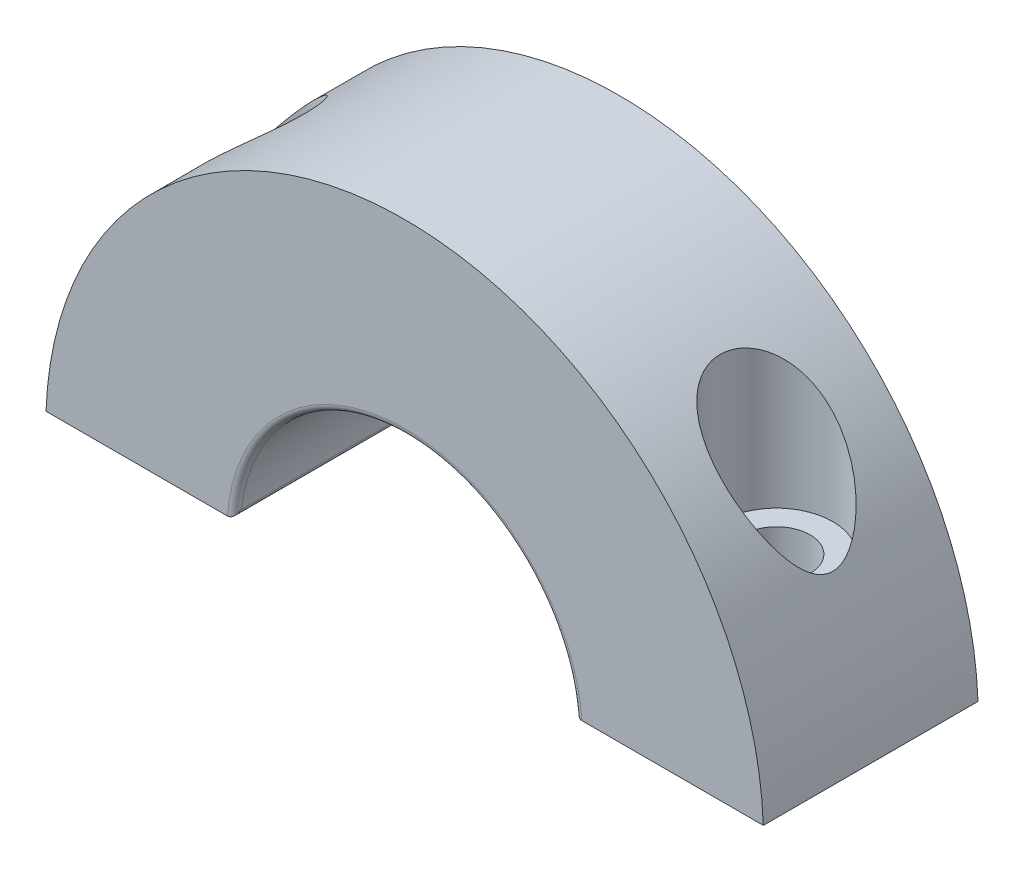
ISO-10303-21;
HEADER;
FILE_DESCRIPTION(('STEP AP214'),'2;1');
FILE_NAME('part.step','',(''),(''),'','','');
FILE_SCHEMA(('AUTOMOTIVE_DESIGN { 1 0 10303 214 1 1 1 1 }'));
ENDSEC;
DATA;
#1=APPLICATION_CONTEXT('core data for automotive mechanical design processes');
#2=APPLICATION_PROTOCOL_DEFINITION('international standard','automotive_design',2000,#1);
#3=PRODUCT_CONTEXT('',#1,'mechanical');
#4=PRODUCT('Part','Part','',(#3));
#5=PRODUCT_RELATED_PRODUCT_CATEGORY('part','',(#4));
#6=PRODUCT_DEFINITION_FORMATION('','',#4);
#7=PRODUCT_DEFINITION_CONTEXT('part definition',#1,'design');
#8=PRODUCT_DEFINITION('design','',#6,#7);
#9=PRODUCT_DEFINITION_SHAPE('','',#8);
#10=(LENGTH_UNIT() NAMED_UNIT(*) SI_UNIT(.MILLI.,.METRE.));
#11=(NAMED_UNIT(*) PLANE_ANGLE_UNIT() SI_UNIT($,.RADIAN.));
#12=(NAMED_UNIT(*) SI_UNIT($,.STERADIAN.) SOLID_ANGLE_UNIT());
#13=UNCERTAINTY_MEASURE_WITH_UNIT(LENGTH_MEASURE(1.E-05),#10,'distance_accuracy_value','');
#14=(GEOMETRIC_REPRESENTATION_CONTEXT(3) GLOBAL_UNCERTAINTY_ASSIGNED_CONTEXT((#13)) GLOBAL_UNIT_ASSIGNED_CONTEXT((#10,
#11,#12)) REPRESENTATION_CONTEXT('',''));
#15=CARTESIAN_POINT('',(0.,0.,0.));
#16=DIRECTION('',(0.,0.,1.));
#17=DIRECTION('',(1.,0.,0.));
#18=AXIS2_PLACEMENT_3D('',#15,#16,#17);
#19=CARTESIAN_POINT('',(0.,50.,8.));
#20=DIRECTION('',(0.,0.,-1.));
#21=DIRECTION('',(-1.,0.,0.));
#22=AXIS2_PLACEMENT_3D('',#19,#20,#21);
#23=CYLINDRICAL_SURFACE('',#22,26.75);
#24=CARTESIAN_POINT('',(0.,50.,-8.));
#25=DIRECTION('',(0.,0.,1.));
#26=DIRECTION('',(1.,0.,0.));
#27=AXIS2_PLACEMENT_3D('',#24,#25,#26);
#28=CIRCLE('',#27,26.75);
#29=CARTESIAN_POINT('',(26.7313018762649,51.,-8.));
#30=VERTEX_POINT('',#29);
#31=CARTESIAN_POINT('',(-26.7313018762649,51.,-8.));
#32=VERTEX_POINT('',#31);
#33=EDGE_CURVE('E240',#30,#32,#28,.T.);
#34=ORIENTED_EDGE('',*,*,#33,.T.);
#35=DIRECTION('',(0.,0.,-1.));
#36=VECTOR('',#35,1.);
#37=CARTESIAN_POINT('',(-26.7313018762649,51.,8.));
#38=LINE('',#37,#36);
#39=CARTESIAN_POINT('',(-26.7313018762649,51.,8.));
#40=VERTEX_POINT('',#39);
#41=EDGE_CURVE('E117',#40,#32,#38,.T.);
#42=ORIENTED_EDGE('',*,*,#41,.F.);
#43=CARTESIAN_POINT('',(0.,50.,8.));
#44=DIRECTION('',(0.,0.,1.));
#45=DIRECTION('',(1.,0.,0.));
#46=AXIS2_PLACEMENT_3D('',#43,#44,#45);
#47=CIRCLE('',#46,26.75);
#48=CARTESIAN_POINT('',(26.7313018762649,51.,8.));
#49=VERTEX_POINT('',#48);
#50=EDGE_CURVE('E105',#49,#40,#47,.T.);
#51=ORIENTED_EDGE('',*,*,#50,.F.);
#52=DIRECTION('',(0.,0.,-1.));
#53=VECTOR('',#52,1.);
#54=CARTESIAN_POINT('',(26.7313018762649,51.,8.));
#55=LINE('',#54,#53);
#56=EDGE_CURVE('E115',#49,#30,#55,.T.);
#57=ORIENTED_EDGE('',*,*,#56,.T.);
#58=EDGE_LOOP('',(#34,#42,#51,#57));
#59=FACE_BOUND('',#58,.T.);
#60=CARTESIAN_POINT('',(19.7107238188861,68.0845200803227,4.20000000000001));
#61=CARTESIAN_POINT('',(19.4714095954293,68.3453463817255,4.20000497816206));
#62=CARTESIAN_POINT('',(19.2266851159006,68.6016351112881,4.17959589245028));
#63=CARTESIAN_POINT('',(18.7310891320525,69.1005846370366,4.09190096096163));
#64=CARTESIAN_POINT('',(18.4802137661521,69.3432365400268,4.02458489972411));
#65=CARTESIAN_POINT('',(18.0176450508798,69.774008854698,3.85032773568895));
#66=CARTESIAN_POINT('',(17.8057202812992,69.9648487215048,3.75084696734812));
#67=CARTESIAN_POINT('',(17.3903581019866,70.3276576192102,3.50906039877837));
#68=CARTESIAN_POINT('',(17.1869086359243,70.4996540660037,3.36681797391555));
#69=CARTESIAN_POINT('',(16.8346819522202,70.7893703368425,3.06776616161632));
#70=CARTESIAN_POINT('',(16.6828088237221,70.911219039949,2.91869699716816));
#71=CARTESIAN_POINT('',(16.469165306898,71.0793116839024,2.67285037569269));
#72=CARTESIAN_POINT('',(16.4002816089286,71.1329184533838,2.5871469855567));
#73=CARTESIAN_POINT('',(16.2681614397138,71.2347912887938,2.4085440611072));
#74=CARTESIAN_POINT('',(16.2049224101019,71.2830597766191,2.31564782287071));
#75=CARTESIAN_POINT('',(16.0844849517247,71.3742276764173,2.12214471326689));
#76=CARTESIAN_POINT('',(16.0273465501849,71.4170743882522,2.02147551785926));
#77=CARTESIAN_POINT('',(15.920776895321,71.496413098955,1.81381137171302));
#78=CARTESIAN_POINT('',(15.8713415701149,71.5329084563791,1.70681980454721));
#79=CARTESIAN_POINT('',(15.7810906316817,71.5991392078275,1.48729966072017));
#80=CARTESIAN_POINT('',(15.7402712980325,71.6288775199988,1.37477349990783));
#81=CARTESIAN_POINT('',(15.6680594514251,71.6812455407432,1.14513874797566));
#82=CARTESIAN_POINT('',(15.6366651762454,71.7038765782139,1.02803101811473));
#83=CARTESIAN_POINT('',(15.5877830709638,71.7390037909345,0.807591015573986));
#84=CARTESIAN_POINT('',(15.5689410607936,71.75249207497,0.704714338089931));
#85=CARTESIAN_POINT('',(15.5389507161638,71.7739259857868,0.497279401507693));
#86=CARTESIAN_POINT('',(15.5278014931469,71.7818722527013,0.392721338046529));
#87=CARTESIAN_POINT('',(15.5133875703403,71.792140432896,0.182835982970273));
#88=CARTESIAN_POINT('',(15.5101193352698,71.7944648680383,0.0775090575301949));
#89=CARTESIAN_POINT('',(15.5115120104351,71.7934737004913,-0.133063170857504));
#90=CARTESIAN_POINT('',(15.5161726331045,71.7901583023493,-0.238308476626832));
#91=CARTESIAN_POINT('',(15.532652448142,71.7784136496357,-0.439381505161563));
#92=CARTESIAN_POINT('',(15.5438645676484,71.7704179778506,-0.535284750144623));
#93=CARTESIAN_POINT('',(15.5727566108595,71.7497599449175,-0.725610761966265));
#94=CARTESIAN_POINT('',(15.5904385636948,71.7370961196896,-0.820033054635112));
#95=CARTESIAN_POINT('',(15.6528433268761,71.6922494962692,-1.10002573212135));
#96=CARTESIAN_POINT('',(15.706942979808,71.6531990329416,-1.28253300314999));
#97=CARTESIAN_POINT('',(15.8385981107842,71.5570872066471,-1.63810278451527));
#98=CARTESIAN_POINT('',(15.9166044958324,71.4996785956956,-1.81090069306073));
#99=CARTESIAN_POINT('',(16.0918798702953,71.3688054996274,-2.13979235307788));
#100=CARTESIAN_POINT('',(16.1891542728485,71.2953365019186,-2.29588139134938));
#101=CARTESIAN_POINT('',(16.4097746670825,71.1258846280329,-2.60448462958515));
#102=CARTESIAN_POINT('',(16.5347765128137,71.0283592328429,-2.75495995340419));
#103=CARTESIAN_POINT('',(16.7980984164106,70.8186173495007,-3.0320325698474));
#104=CARTESIAN_POINT('',(16.9364270996453,70.7063913297125,-3.15861423911618));
#105=CARTESIAN_POINT('',(17.2891423340684,70.4137708770266,-3.44216367426133));
#106=CARTESIAN_POINT('',(17.5086596454303,70.2261692764753,-3.58535324359991));
#107=CARTESIAN_POINT('',(17.9553739928629,69.8306942970467,-3.82402428183115));
#108=CARTESIAN_POINT('',(18.1825853880805,69.6227814756974,-3.91941062887696));
#109=CARTESIAN_POINT('',(18.5636007483214,69.2613753255626,-4.04355740294428));
#110=CARTESIAN_POINT('',(18.7175662511078,69.1118261457105,-4.08387531183579));
#111=CARTESIAN_POINT('',(19.0237107694674,68.8071138292121,-4.14637539529523));
#112=CARTESIAN_POINT('',(19.1758891460257,68.6519487608856,-4.16855126648878));
#113=CARTESIAN_POINT('',(19.4772980191638,68.3369836668683,-4.19624256845949));
#114=CARTESIAN_POINT('',(19.6265242100315,68.1771776056803,-4.20173522480263));
#115=CARTESIAN_POINT('',(19.9208806112278,67.8540973079676,-4.1973203642498));
#116=CARTESIAN_POINT('',(20.0660108828693,67.6908231234225,-4.18741307800422));
#117=CARTESIAN_POINT('',(20.3946640673978,67.3118638258244,-4.14816740364362));
#118=CARTESIAN_POINT('',(20.576534403753,67.0952519012439,-4.11386149061764));
#119=CARTESIAN_POINT('',(20.9311524028456,66.6591838963115,-4.02294415690537));
#120=CARTESIAN_POINT('',(21.1038962867661,66.4397266839825,-3.96632357763034));
#121=CARTESIAN_POINT('',(21.4394996614947,65.9995929945374,-3.83197359262129));
#122=CARTESIAN_POINT('',(21.6023551354311,65.7789160611371,-3.7542356778658));
#123=CARTESIAN_POINT('',(21.9174033199813,65.3382917837208,-3.57814786718326));
#124=CARTESIAN_POINT('',(22.0696008448651,65.1183441536068,-3.47980735877477));
#125=CARTESIAN_POINT('',(22.3113112740541,64.7579520300967,-3.30015020800983));
#126=CARTESIAN_POINT('',(22.4041093109456,64.6166424893679,-3.22493407572468));
#127=CARTESIAN_POINT('',(22.5846453245567,64.3361113755285,-3.06514484243086));
#128=CARTESIAN_POINT('',(22.672384320883,64.1968893859045,-2.98057363695599));
#129=CARTESIAN_POINT('',(22.842254857694,63.9219231885345,-2.80155545957027));
#130=CARTESIAN_POINT('',(22.9243982844024,63.7861720175101,-2.70713057358432));
#131=CARTESIAN_POINT('',(23.0826858938636,63.5194721872854,-2.50721419409781));
#132=CARTESIAN_POINT('',(23.1588332794068,63.388520984435,-2.40172867982263));
#133=CARTESIAN_POINT('',(23.3089388870057,63.1255551636338,-2.17094969411525));
#134=CARTESIAN_POINT('',(23.3824462822169,62.9940073125088,-2.04482120654592));
#135=CARTESIAN_POINT('',(23.5199133110222,62.7434879946723,-1.77564425071371));
#136=CARTESIAN_POINT('',(23.5838776944393,62.6245102801176,-1.63260426375234));
#137=CARTESIAN_POINT('',(23.6846728368684,62.4341214612035,-1.36483475198118));
#138=CARTESIAN_POINT('',(23.7242960554058,62.3582379445303,-1.24439153372626));
#139=CARTESIAN_POINT('',(23.7940376146238,62.2234211796413,-0.991774148489328));
#140=CARTESIAN_POINT('',(23.8241762457353,62.1644517712639,-0.859625809796448));
#141=CARTESIAN_POINT('',(23.8663669497563,62.0814186387221,-0.617934697657543));
#142=CARTESIAN_POINT('',(23.8810244884459,62.0523729541035,-0.510585984048181));
#143=CARTESIAN_POINT('',(23.9019969627876,62.0107286943891,-0.291962117006058));
#144=CARTESIAN_POINT('',(23.9083216131493,61.9981109673333,-0.180691691349285));
#145=CARTESIAN_POINT('',(23.9119963826372,61.9907861900317,0.0429354883707543));
#146=CARTESIAN_POINT('',(23.909320087567,61.9961318551619,0.155294473234554));
#147=CARTESIAN_POINT('',(23.8952279087877,62.0241760285166,0.377273309755489));
#148=CARTESIAN_POINT('',(23.8838039841121,62.0468905024122,0.4868905453616));
#149=CARTESIAN_POINT('',(23.849354742896,62.1149724815535,0.728109878473586));
#150=CARTESIAN_POINT('',(23.824107927781,62.164650969769,0.858154916079965));
#151=CARTESIAN_POINT('',(23.7640592295639,62.281541912397,1.10772725803315));
#152=CARTESIAN_POINT('',(23.7292358659285,62.3487937673923,1.22723011040395));
#153=CARTESIAN_POINT('',(23.6588806855948,62.482972252903,1.43596726680176));
#154=CARTESIAN_POINT('',(23.6245012911472,62.5479646068591,1.52687208628644));
#155=CARTESIAN_POINT('',(23.5515678714845,62.6843261804054,1.70203562663636));
#156=CARTESIAN_POINT('',(23.5130109452751,62.7556998252511,1.78628965791316));
#157=CARTESIAN_POINT('',(23.4323136357035,62.9033434153271,1.94885100560794));
#158=CARTESIAN_POINT('',(23.390166354221,62.9796227136007,2.02714630133867));
#159=CARTESIAN_POINT('',(23.3027995729068,63.1358311968023,2.17821001709809));
#160=CARTESIAN_POINT('',(23.2575789324916,63.215761733128,2.2509763637723));
#161=CARTESIAN_POINT('',(23.1224591024417,63.4516171583935,2.45474735263323));
#162=CARTESIAN_POINT('',(23.0289886941477,63.611173344606,2.57920441153372));
#163=CARTESIAN_POINT('',(22.8336256247614,63.9364328677547,2.81258302271555));
#164=CARTESIAN_POINT('',(22.7317258206421,64.1021413512094,2.92149118146771));
#165=CARTESIAN_POINT('',(22.5201820909686,64.4375648573,3.125469461666));
#166=CARTESIAN_POINT('',(22.4105251407763,64.6072862838374,3.22051544755737));
#167=CARTESIAN_POINT('',(22.1841968192202,64.9487752484552,3.39743233069186));
#168=CARTESIAN_POINT('',(22.067527695543,65.1205421168811,3.47930741913099));
#169=CARTESIAN_POINT('',(21.816975529481,65.4801231544611,3.63696194663123));
#170=CARTESIAN_POINT('',(21.6824804157652,65.6680224677405,3.71157548186172));
#171=CARTESIAN_POINT('',(21.4059664082543,66.0437379738069,3.84574659472114));
#172=CARTESIAN_POINT('',(21.2639456292012,66.2315541337674,3.90530037795095));
#173=CARTESIAN_POINT('',(20.9732828719773,66.6054148044341,4.00869850791283));
#174=CARTESIAN_POINT('',(20.8246627827969,66.7914630022145,4.05259097842356));
#175=CARTESIAN_POINT('',(20.5209577303433,67.1612933575927,4.12405618036519));
#176=CARTESIAN_POINT('',(20.3658763167139,67.3450766893603,4.15163774916858));
#177=CARTESIAN_POINT('',(20.126522015588,67.6210400137729,4.18017025638862));
#178=CARTESIAN_POINT('',(20.044374066753,67.7144302006943,4.1875491939417));
#179=CARTESIAN_POINT('',(19.8786162164645,67.9002415916422,4.19746451978066));
#180=CARTESIAN_POINT('',(19.7950055370189,67.9926622354403,4.19999824679017));
#181=CARTESIAN_POINT('',(19.7107238188861,68.0845200803227,4.20000000000001));
#182=B_SPLINE_CURVE_WITH_KNOTS('',3,(#60,#61,#62,#63,#64,#65,#66,#67,#68,#69,#70,#71,#72,#73,
#74,#75,#76,#77,#78,#79,#80,#81,#82,#83,#84,#85,#86,#87,#88,#89,#90,#91,#92,#93,#94,#95,#96,#97,
#98,#99,#100,#101,#102,#103,#104,#105,#106,#107,#108,#109,#110,#111,#112,#113,#114,#115,#116,
#117,#118,#119,#120,#121,#122,#123,#124,#125,#126,#127,#128,#129,#130,#131,#132,#133,#134,#135,
#136,#137,#138,#139,#140,#141,#142,#143,#144,#145,#146,#147,#148,#149,#150,#151,#152,#153,#154,
#155,#156,#157,#158,#159,#160,#161,#162,#163,#164,#165,#166,#167,#168,#169,#170,#171,#172,#173,
#174,#175,#176,#177,#178,#179,#180,#181),.UNSPECIFIED.,.T.,.F.,(4,2,2,2,2,2,2,2,2,2,2,2,2,2,2,2,
2,2,2,2,2,2,2,2,2,2,2,2,2,2,2,2,2,2,2,2,2,2,2,2,2,2,2,2,2,2,2,2,2,2,2,2,2,2,2,2,2,2,2,2,4),(0.,
1.06166433918217,2.12401318993045,3.0269747848979,3.92860467880954,4.66107002537485,
5.0276614956142,5.39408596068029,5.76383576258066,6.13338944507555,6.50278322478132,
6.87210789514023,7.18804840678605,7.50395241953265,7.81971469658375,8.13546552171441,
8.42577421294324,8.71617403169176,9.29634490462091,9.88821270557517,10.4802470217467,
11.1335043328663,11.7871873211321,12.7488215220551,13.7123617197468,14.366736440687,
15.0213384249164,15.6768336125624,16.3323189827192,17.1859031129036,18.039837944323,
18.8941173720366,19.7480083928365,20.3028374011744,20.8575541947449,21.4110533226243,
21.9642547641287,22.5528064056848,23.1410641243212,23.5831017410135,24.0241871724773,
24.3593294860662,24.6940807348163,25.0298152015542,25.3658586520221,25.7879421130274,
26.2109801546292,26.5612438529729,26.9117523623358,27.2629501830742,27.6142790594987,
28.2819068111803,28.9501062193022,29.6194554915981,30.2885913428032,31.0164624119052,
31.7445166903798,32.4703141506903,33.1957180071887,33.5694099142365,33.9433070161056),.UNSPECIFIED.);
#183=CARTESIAN_POINT('',(19.7107238188861,68.0845200803227,4.20000000000001));
#184=VERTEX_POINT('',#183);
#185=EDGE_CURVE('E137',#184,#184,#182,.T.);
#186=ORIENTED_EDGE('',*,*,#185,.T.);
#187=EDGE_LOOP('',(#186));
#188=FACE_BOUND('',#187,.T.);
#189=CARTESIAN_POINT('',(-19.7107238188862,68.0845200803227,4.20000000000001));
#190=CARTESIAN_POINT('',(-19.4714095954293,68.3453463817255,4.20000497816206));
#191=CARTESIAN_POINT('',(-19.2266851159007,68.6016351112881,4.17959589245028));
#192=CARTESIAN_POINT('',(-18.7310891320525,69.1005846370366,4.09190096096163));
#193=CARTESIAN_POINT('',(-18.4802137661522,69.3432365400268,4.0245848997241));
#194=CARTESIAN_POINT('',(-18.0176450508798,69.774008854698,3.85032773568895));
#195=CARTESIAN_POINT('',(-17.8057202812992,69.9648487215048,3.75084696734811));
#196=CARTESIAN_POINT('',(-17.3903581019866,70.3276576192102,3.50906039877837));
#197=CARTESIAN_POINT('',(-17.1869086359244,70.4996540660037,3.36681797391554));
#198=CARTESIAN_POINT('',(-16.8346819522203,70.7893703368425,3.06776616161631));
#199=CARTESIAN_POINT('',(-16.6828088237221,70.911219039949,2.91869699716815));
#200=CARTESIAN_POINT('',(-16.469165306898,71.0793116839024,2.67285037569269));
#201=CARTESIAN_POINT('',(-16.4002816089286,71.1329184533838,2.5871469855567));
#202=CARTESIAN_POINT('',(-16.2681614397138,71.2347912887938,2.40854406110719));
#203=CARTESIAN_POINT('',(-16.2049224101019,71.2830597766191,2.31564782287071));
#204=CARTESIAN_POINT('',(-16.0844849517248,71.3742276764173,2.12214471326689));
#205=CARTESIAN_POINT('',(-16.0273465501849,71.4170743882521,2.02147551785926));
#206=CARTESIAN_POINT('',(-15.920776895321,71.496413098955,1.81381137171302));
#207=CARTESIAN_POINT('',(-15.871341570115,71.5329084563791,1.70681980454721));
#208=CARTESIAN_POINT('',(-15.7810906316817,71.5991392078275,1.48729966072017));
#209=CARTESIAN_POINT('',(-15.7402712980325,71.6288775199988,1.37477349990783));
#210=CARTESIAN_POINT('',(-15.6680594514251,71.6812455407432,1.14513874797566));
#211=CARTESIAN_POINT('',(-15.6366651762454,71.7038765782139,1.02803101811473));
#212=CARTESIAN_POINT('',(-15.5877830709638,71.7390037909345,0.807591015573979));
#213=CARTESIAN_POINT('',(-15.5689410607937,71.75249207497,0.704714338089923));
#214=CARTESIAN_POINT('',(-15.5389507161639,71.7739259857868,0.497279401507686));
#215=CARTESIAN_POINT('',(-15.5278014931469,71.7818722527013,0.392721338046523));
#216=CARTESIAN_POINT('',(-15.5133875703403,71.792140432896,0.182835982970267));
#217=CARTESIAN_POINT('',(-15.5101193352699,71.7944648680383,0.0775090575301894));
#218=CARTESIAN_POINT('',(-15.5115120104351,71.7934737004913,-0.133063170857508));
#219=CARTESIAN_POINT('',(-15.5161726331045,71.7901583023493,-0.238308476626836));
#220=CARTESIAN_POINT('',(-15.532652448142,71.7784136496357,-0.439381505161566));
#221=CARTESIAN_POINT('',(-15.5438645676484,71.7704179778506,-0.535284750144627));
#222=CARTESIAN_POINT('',(-15.5727566108596,71.7497599449175,-0.72561076196627));
#223=CARTESIAN_POINT('',(-15.5904385636948,71.7370961196896,-0.820033054635117));
#224=CARTESIAN_POINT('',(-15.6528433268761,71.6922494962692,-1.10002573212136));
#225=CARTESIAN_POINT('',(-15.706942979808,71.6531990329416,-1.28253300314999));
#226=CARTESIAN_POINT('',(-15.8385981107843,71.5570872066471,-1.63810278451528));
#227=CARTESIAN_POINT('',(-15.9166044958324,71.4996785956956,-1.81090069306073));
#228=CARTESIAN_POINT('',(-16.0918798702953,71.3688054996274,-2.13979235307788));
#229=CARTESIAN_POINT('',(-16.1891542728486,71.2953365019186,-2.29588139134939));
#230=CARTESIAN_POINT('',(-16.4097746670825,71.1258846280329,-2.60448462958516));
#231=CARTESIAN_POINT('',(-16.5347765128138,71.0283592328429,-2.75495995340419));
#232=CARTESIAN_POINT('',(-16.7980984164107,70.8186173495007,-3.03203256984741));
#233=CARTESIAN_POINT('',(-16.9364270996454,70.7063913297125,-3.15861423911618));
#234=CARTESIAN_POINT('',(-17.2891423340685,70.4137708770266,-3.44216367426133));
#235=CARTESIAN_POINT('',(-17.5086596454303,70.2261692764753,-3.58535324359991));
#236=CARTESIAN_POINT('',(-17.955373992863,69.8306942970467,-3.82402428183115));
#237=CARTESIAN_POINT('',(-18.1825853880806,69.6227814756974,-3.91941062887696));
#238=CARTESIAN_POINT('',(-18.5636007483215,69.2613753255626,-4.04355740294429));
#239=CARTESIAN_POINT('',(-18.7175662511078,69.1118261457105,-4.08387531183579));
#240=CARTESIAN_POINT('',(-19.0237107694674,68.8071138292121,-4.14637539529523));
#241=CARTESIAN_POINT('',(-19.1758891460257,68.6519487608856,-4.16855126648879));
#242=CARTESIAN_POINT('',(-19.4772980191638,68.3369836668683,-4.1962425684595));
#243=CARTESIAN_POINT('',(-19.6265242100315,68.1771776056803,-4.20173522480264));
#244=CARTESIAN_POINT('',(-19.9208806112279,67.8540973079676,-4.1973203642498));
#245=CARTESIAN_POINT('',(-20.0660108828694,67.6908231234225,-4.18741307800422));
#246=CARTESIAN_POINT('',(-20.3946640673978,67.3118638258244,-4.14816740364362));
#247=CARTESIAN_POINT('',(-20.576534403753,67.0952519012439,-4.11386149061765));
#248=CARTESIAN_POINT('',(-20.9311524028457,66.6591838963115,-4.02294415690537));
#249=CARTESIAN_POINT('',(-21.1038962867661,66.4397266839825,-3.96632357763033));
#250=CARTESIAN_POINT('',(-21.4394996614947,65.9995929945373,-3.83197359262129));
#251=CARTESIAN_POINT('',(-21.6023551354312,65.7789160611371,-3.7542356778658));
#252=CARTESIAN_POINT('',(-21.9174033199814,65.3382917837208,-3.57814786718327));
#253=CARTESIAN_POINT('',(-22.0696008448652,65.1183441536068,-3.47980735877477));
#254=CARTESIAN_POINT('',(-22.3113112740541,64.7579520300967,-3.30015020800983));
#255=CARTESIAN_POINT('',(-22.4041093109457,64.6166424893679,-3.22493407572468));
#256=CARTESIAN_POINT('',(-22.5846453245568,64.3361113755284,-3.06514484243086));
#257=CARTESIAN_POINT('',(-22.672384320883,64.1968893859045,-2.98057363695599));
#258=CARTESIAN_POINT('',(-22.8422548576941,63.9219231885345,-2.80155545957028));
#259=CARTESIAN_POINT('',(-22.9243982844025,63.7861720175102,-2.70713057358433));
#260=CARTESIAN_POINT('',(-23.0826858938636,63.5194721872854,-2.50721419409782));
#261=CARTESIAN_POINT('',(-23.1588332794068,63.388520984435,-2.40172867982264));
#262=CARTESIAN_POINT('',(-23.3089388870057,63.1255551636338,-2.17094969411527));
#263=CARTESIAN_POINT('',(-23.382446282217,62.9940073125088,-2.04482120654593));
#264=CARTESIAN_POINT('',(-23.5199133110223,62.7434879946723,-1.77564425071372));
#265=CARTESIAN_POINT('',(-23.5838776944393,62.6245102801176,-1.63260426375235));
#266=CARTESIAN_POINT('',(-23.6846728368684,62.4341214612035,-1.36483475198118));
#267=CARTESIAN_POINT('',(-23.7242960554059,62.3582379445303,-1.24439153372626));
#268=CARTESIAN_POINT('',(-23.7940376146239,62.2234211796413,-0.991774148489332));
#269=CARTESIAN_POINT('',(-23.8241762457353,62.1644517712639,-0.859625809796452));
#270=CARTESIAN_POINT('',(-23.8663669497564,62.0814186387221,-0.617934697657546));
#271=CARTESIAN_POINT('',(-23.8810244884459,62.0523729541035,-0.510585984048184));
#272=CARTESIAN_POINT('',(-23.9019969627877,62.0107286943891,-0.291962117006061));
#273=CARTESIAN_POINT('',(-23.9083216131493,61.9981109673333,-0.180691691349288));
#274=CARTESIAN_POINT('',(-23.9119963826373,61.9907861900317,0.0429354883707516));
#275=CARTESIAN_POINT('',(-23.909320087567,61.9961318551619,0.155294473234551));
#276=CARTESIAN_POINT('',(-23.8952279087877,62.0241760285166,0.377273309755487));
#277=CARTESIAN_POINT('',(-23.8838039841121,62.0468905024122,0.486890545361598));
#278=CARTESIAN_POINT('',(-23.849354742896,62.1149724815535,0.728109878473583));
#279=CARTESIAN_POINT('',(-23.824107927781,62.164650969769,0.858154916079962));
#280=CARTESIAN_POINT('',(-23.764059229564,62.281541912397,1.10772725803315));
#281=CARTESIAN_POINT('',(-23.7292358659285,62.3487937673923,1.22723011040395));
#282=CARTESIAN_POINT('',(-23.6588806855949,62.482972252903,1.43596726680176));
#283=CARTESIAN_POINT('',(-23.6245012911472,62.5479646068591,1.52687208628643));
#284=CARTESIAN_POINT('',(-23.5515678714846,62.6843261804054,1.70203562663635));
#285=CARTESIAN_POINT('',(-23.5130109452751,62.7556998252511,1.78628965791315));
#286=CARTESIAN_POINT('',(-23.4323136357036,62.9033434153271,1.94885100560793));
#287=CARTESIAN_POINT('',(-23.390166354221,62.9796227136007,2.02714630133866));
#288=CARTESIAN_POINT('',(-23.3027995729068,63.1358311968023,2.17821001709808));
#289=CARTESIAN_POINT('',(-23.2575789324916,63.215761733128,2.25097636377229));
#290=CARTESIAN_POINT('',(-23.1224591024418,63.4516171583935,2.45474735263323));
#291=CARTESIAN_POINT('',(-23.0289886941477,63.611173344606,2.57920441153373));
#292=CARTESIAN_POINT('',(-22.8336256247614,63.9364328677547,2.81258302271556));
#293=CARTESIAN_POINT('',(-22.7317258206421,64.1021413512094,2.92149118146772));
#294=CARTESIAN_POINT('',(-22.5201820909686,64.4375648573,3.125469461666));
#295=CARTESIAN_POINT('',(-22.4105251407764,64.6072862838374,3.22051544755737));
#296=CARTESIAN_POINT('',(-22.1841968192203,64.9487752484552,3.39743233069186));
#297=CARTESIAN_POINT('',(-22.0675276955431,65.1205421168811,3.47930741913099));
#298=CARTESIAN_POINT('',(-21.8169755294811,65.4801231544611,3.63696194663123));
#299=CARTESIAN_POINT('',(-21.6824804157653,65.6680224677405,3.71157548186172));
#300=CARTESIAN_POINT('',(-21.4059664082544,66.0437379738069,3.84574659472114));
#301=CARTESIAN_POINT('',(-21.2639456292012,66.2315541337674,3.90530037795095));
#302=CARTESIAN_POINT('',(-20.9732828719773,66.6054148044341,4.00869850791282));
#303=CARTESIAN_POINT('',(-20.8246627827969,66.7914630022145,4.05259097842356));
#304=CARTESIAN_POINT('',(-20.5209577303433,67.1612933575927,4.12405618036518));
#305=CARTESIAN_POINT('',(-20.365876316714,67.3450766893603,4.15163774916858));
#306=CARTESIAN_POINT('',(-20.126522015588,67.6210400137729,4.18017025638861));
#307=CARTESIAN_POINT('',(-20.0443740667531,67.7144302006943,4.1875491939417));
#308=CARTESIAN_POINT('',(-19.8786162164645,67.9002415916422,4.19746451978066));
#309=CARTESIAN_POINT('',(-19.795005537019,67.9926622354403,4.19999824679017));
#310=CARTESIAN_POINT('',(-19.7107238188862,68.0845200803227,4.20000000000001));
#311=B_SPLINE_CURVE_WITH_KNOTS('',3,(#189,#190,#191,#192,#193,#194,#195,#196,#197,#198,#199,
#200,#201,#202,#203,#204,#205,#206,#207,#208,#209,#210,#211,#212,#213,#214,#215,#216,#217,#218,
#219,#220,#221,#222,#223,#224,#225,#226,#227,#228,#229,#230,#231,#232,#233,#234,#235,#236,#237,
#238,#239,#240,#241,#242,#243,#244,#245,#246,#247,#248,#249,#250,#251,#252,#253,#254,#255,#256,
#257,#258,#259,#260,#261,#262,#263,#264,#265,#266,#267,#268,#269,#270,#271,#272,#273,#274,#275,
#276,#277,#278,#279,#280,#281,#282,#283,#284,#285,#286,#287,#288,#289,#290,#291,#292,#293,#294,
#295,#296,#297,#298,#299,#300,#301,#302,#303,#304,#305,#306,#307,#308,#309,#310),.UNSPECIFIED.,
.T.,.F.,(4,2,2,2,2,2,2,2,2,2,2,2,2,2,2,2,2,2,2,2,2,2,2,2,2,2,2,2,2,2,2,2,2,2,2,2,2,2,2,2,2,2,2,
2,2,2,2,2,2,2,2,2,2,2,2,2,2,2,2,2,4),(0.,1.06166433918217,2.12401318993045,3.0269747848979,
3.92860467880954,4.66107002537485,5.0276614956142,5.39408596068029,5.76383576258065,
6.13338944507554,6.50278322478131,6.87210789514023,7.18804840678605,7.50395241953265,
7.81971469658375,8.13546552171441,8.42577421294324,8.71617403169176,9.29634490462091,
9.88821270557517,10.4802470217467,11.1335043328663,11.7871873211321,12.7488215220551,
13.7123617197468,14.366736440687,15.0213384249164,15.6768336125624,16.3323189827192,
17.1859031129036,18.0398379443231,18.8941173720367,19.7480083928365,20.3028374011744,
20.8575541947449,21.4110533226243,21.9642547641287,22.5528064056848,23.1410641243212,
23.5831017410135,24.0241871724773,24.3593294860662,24.6940807348164,25.0298152015542,
25.3658586520221,25.7879421130274,26.2109801546292,26.5612438529729,26.9117523623358,
27.2629501830742,27.6142790594987,28.2819068111803,28.9501062193022,29.6194554915982,
30.2885913428033,31.0164624119052,31.7445166903798,32.4703141506903,33.1957180071887,
33.5694099142365,33.9433070161056),.UNSPECIFIED.);
#312=CARTESIAN_POINT('',(-19.7107238188862,68.0845200803227,4.20000000000001));
#313=VERTEX_POINT('',#312);
#314=EDGE_CURVE('E136',#313,#313,#311,.T.);
#315=ORIENTED_EDGE('',*,*,#314,.F.);
#316=EDGE_LOOP('',(#315));
#317=FACE_BOUND('',#316,.T.);
#318=ADVANCED_FACE('F34',(#59,#188,#317),#23,.T.);
#319=CARTESIAN_POINT('',(0.,51.,8.));
#320=DIRECTION('',(0.,1.,0.));
#321=DIRECTION('',(0.,0.,1.));
#322=AXIS2_PLACEMENT_3D('',#319,#320,#321);
#323=PLANE('',#322);
#324=CARTESIAN_POINT('',(19.7107238188861,51.,0.));
#325=DIRECTION('',(0.,1.,0.));
#326=DIRECTION('',(0.,0.,1.));
#327=AXIS2_PLACEMENT_3D('',#324,#325,#326);
#328=CIRCLE('',#327,2.5);
#329=CARTESIAN_POINT('',(19.7107238188861,51.,2.50000000000001));
#330=VERTEX_POINT('',#329);
#331=EDGE_CURVE('E135',#330,#330,#328,.F.);
#332=ORIENTED_EDGE('',*,*,#331,.F.);
#333=EDGE_LOOP('',(#332));
#334=FACE_BOUND('',#333,.T.);
#335=DIRECTION('',(1.,0.,0.));
#336=VECTOR('',#335,1.);
#337=CARTESIAN_POINT('',(0.,51.,8.));
#338=LINE('',#337,#336);
#339=CARTESIAN_POINT('',(13.2122102617238,51.,8.));
#340=VERTEX_POINT('',#339);
#341=EDGE_CURVE('E101',#340,#49,#338,.T.);
#342=ORIENTED_EDGE('',*,*,#341,.F.);
#343=CARTESIAN_POINT('',(13.2122102617238,51.,8.));
#344=CARTESIAN_POINT('',(13.2042943710993,51.,7.99999979202778));
#345=CARTESIAN_POINT('',(13.196387282761,51.,7.99981319171387));
#346=CARTESIAN_POINT('',(13.1805907107472,51.,7.99906720640696));
#347=CARTESIAN_POINT('',(13.1727012270714,51.,7.99850782141821));
#348=CARTESIAN_POINT('',(13.1648205456816,51.,7.99776204409204));
#349=B_SPLINE_CURVE_WITH_KNOTS('',3,(#343,#344,#345,#346,#347,#348),.UNSPECIFIED.,.F.,.F.,(4,2,
4),(0.,0.0237278694998126,0.0474557387283162),.UNSPECIFIED.);
#350=CARTESIAN_POINT('',(13.1648205456816,51.,7.99776204409204));
#351=VERTEX_POINT('',#350);
#352=EDGE_CURVE('E48',#340,#351,#349,.T.);
#353=ORIENTED_EDGE('',*,*,#352,.T.);
#354=DIRECTION('',(0.,0.,1.));
#355=VECTOR('',#354,1.);
#356=CARTESIAN_POINT('',(13.1648205456816,51.,-8.));
#357=LINE('',#356,#355);
#358=CARTESIAN_POINT('',(13.1648205456816,51.,-7.99776204409204));
#359=VERTEX_POINT('',#358);
#360=EDGE_CURVE('E59',#351,#359,#357,.F.);
#361=ORIENTED_EDGE('',*,*,#360,.T.);
#362=CARTESIAN_POINT('',(13.1648205456816,51.,-7.99776204409204));
#363=CARTESIAN_POINT('',(13.1727012270714,51.,-7.99850782141821));
#364=CARTESIAN_POINT('',(13.1805907107472,51.,-7.99906720640696));
#365=CARTESIAN_POINT('',(13.196387282761,51.,-7.99981319171387));
#366=CARTESIAN_POINT('',(13.2042943710993,51.,-7.99999979202778));
#367=CARTESIAN_POINT('',(13.2122102617238,51.,-8.));
#368=B_SPLINE_CURVE_WITH_KNOTS('',3,(#362,#363,#364,#365,#366,#367),.UNSPECIFIED.,.F.,.F.,(4,2,
4),(0.,0.0237278692285036,0.0474557387283179),.UNSPECIFIED.);
#369=CARTESIAN_POINT('',(13.2122102617238,51.,-8.));
#370=VERTEX_POINT('',#369);
#371=EDGE_CURVE('E229',#359,#370,#368,.T.);
#372=ORIENTED_EDGE('',*,*,#371,.T.);
#373=DIRECTION('',(1.,0.,0.));
#374=VECTOR('',#373,1.);
#375=CARTESIAN_POINT('',(0.,51.,-8.));
#376=LINE('',#375,#374);
#377=EDGE_CURVE('E123',#370,#30,#376,.T.);
#378=ORIENTED_EDGE('',*,*,#377,.T.);
#379=ORIENTED_EDGE('',*,*,#56,.F.);
#380=EDGE_LOOP('',(#342,#353,#361,#372,#378,#379));
#381=FACE_BOUND('',#380,.T.);
#382=ADVANCED_FACE('F121',(#334,#381),#323,.F.);
#383=CARTESIAN_POINT('',(0.,51.,8.));
#384=DIRECTION('',(0.,1.,0.));
#385=DIRECTION('',(0.,0.,1.));
#386=AXIS2_PLACEMENT_3D('',#383,#384,#385);
#387=PLANE('',#386);
#388=CARTESIAN_POINT('',(-19.7107238188862,51.,0.));
#389=DIRECTION('',(0.,1.,0.));
#390=DIRECTION('',(0.,0.,1.));
#391=AXIS2_PLACEMENT_3D('',#388,#389,#390);
#392=CIRCLE('',#391,2.5);
#393=CARTESIAN_POINT('',(-19.7107238188862,51.,2.5));
#394=VERTEX_POINT('',#393);
#395=EDGE_CURVE('E132',#394,#394,#392,.F.);
#396=ORIENTED_EDGE('',*,*,#395,.F.);
#397=EDGE_LOOP('',(#396));
#398=FACE_BOUND('',#397,.T.);
#399=DIRECTION('',(0.,0.,1.));
#400=VECTOR('',#399,1.);
#401=CARTESIAN_POINT('',(-13.1648205456816,51.,8.));
#402=LINE('',#401,#400);
#403=CARTESIAN_POINT('',(-13.1648205456816,51.,-7.99776204409204));
#404=VERTEX_POINT('',#403);
#405=CARTESIAN_POINT('',(-13.1648205456816,51.,7.99776204409204));
#406=VERTEX_POINT('',#405);
#407=EDGE_CURVE('E198',#404,#406,#402,.T.);
#408=ORIENTED_EDGE('',*,*,#407,.T.);
#409=CARTESIAN_POINT('',(-13.1648205456816,51.,7.99776204409204));
#410=CARTESIAN_POINT('',(-13.1727012270714,51.,7.99850782141821));
#411=CARTESIAN_POINT('',(-13.1805907107472,51.,7.99906720640696));
#412=CARTESIAN_POINT('',(-13.1963872827611,51.,7.99981319171387));
#413=CARTESIAN_POINT('',(-13.2042943710994,51.,7.99999979202778));
#414=CARTESIAN_POINT('',(-13.2122102617238,51.,8.));
#415=B_SPLINE_CURVE_WITH_KNOTS('',3,(#409,#410,#411,#412,#413,#414),.UNSPECIFIED.,.F.,.F.,(4,2,
4),(0.,0.0237278692285036,0.0474557387283179),.UNSPECIFIED.);
#416=CARTESIAN_POINT('',(-13.2122102617238,51.,8.));
#417=VERTEX_POINT('',#416);
#418=EDGE_CURVE('E192',#406,#417,#415,.T.);
#419=ORIENTED_EDGE('',*,*,#418,.T.);
#420=DIRECTION('',(1.,0.,0.));
#421=VECTOR('',#420,1.);
#422=CARTESIAN_POINT('',(0.,51.,8.));
#423=LINE('',#422,#421);
#424=EDGE_CURVE('E119',#40,#417,#423,.T.);
#425=ORIENTED_EDGE('',*,*,#424,.F.);
#426=ORIENTED_EDGE('',*,*,#41,.T.);
#427=DIRECTION('',(1.,0.,0.));
#428=VECTOR('',#427,1.);
#429=CARTESIAN_POINT('',(0.,51.,-8.));
#430=LINE('',#429,#428);
#431=CARTESIAN_POINT('',(-13.2122102617238,51.,-8.));
#432=VERTEX_POINT('',#431);
#433=EDGE_CURVE('E110',#32,#432,#430,.T.);
#434=ORIENTED_EDGE('',*,*,#433,.T.);
#435=CARTESIAN_POINT('',(-13.2122102617238,51.,-8.));
#436=CARTESIAN_POINT('',(-13.2042943710994,51.,-7.99999979202778));
#437=CARTESIAN_POINT('',(-13.1963872827611,51.,-7.99981319171387));
#438=CARTESIAN_POINT('',(-13.1805907107472,51.,-7.99906720640696));
#439=CARTESIAN_POINT('',(-13.1727012270714,51.,-7.99850782141821));
#440=CARTESIAN_POINT('',(-13.1648205456816,51.,-7.99776204409204));
#441=B_SPLINE_CURVE_WITH_KNOTS('',3,(#435,#436,#437,#438,#439,#440),.UNSPECIFIED.,.F.,.F.,(4,2,
4),(0.,0.0237278694998143,0.0474557387283179),.UNSPECIFIED.);
#442=EDGE_CURVE('E183',#432,#404,#441,.T.);
#443=ORIENTED_EDGE('',*,*,#442,.T.);
#444=EDGE_LOOP('',(#408,#419,#425,#426,#434,#443));
#445=FACE_BOUND('',#444,.T.);
#446=ADVANCED_FACE('F176',(#398,#445),#387,.F.);
#447=CARTESIAN_POINT('',(0.,50.,8.));
#448=DIRECTION('',(0.,0.,-1.));
#449=DIRECTION('',(-1.,0.,0.));
#450=AXIS2_PLACEMENT_3D('',#447,#448,#449);
#451=CYLINDRICAL_SURFACE('',#450,12.75);
#452=CARTESIAN_POINT('',(0.,50.,7.5));
#453=DIRECTION('',(0.,0.,1.));
#454=DIRECTION('',(1.,0.,0.));
#455=AXIS2_PLACEMENT_3D('',#452,#453,#454);
#456=CIRCLE('',#455,12.75);
#457=CARTESIAN_POINT('',(12.6680348647125,51.4433962264151,7.5));
#458=VERTEX_POINT('',#457);
#459=CARTESIAN_POINT('',(-12.6680348647125,51.4433962264151,7.5));
#460=VERTEX_POINT('',#459);
#461=EDGE_CURVE('E251',#458,#460,#456,.T.);
#462=ORIENTED_EDGE('',*,*,#461,.T.);
#463=DIRECTION('',(0.,0.,-1.));
#464=VECTOR('',#463,1.);
#465=CARTESIAN_POINT('',(-12.6680348647125,51.4433962264151,8.));
#466=LINE('',#465,#464);
#467=CARTESIAN_POINT('',(-12.6680348647125,51.4433962264151,-7.5));
#468=VERTEX_POINT('',#467);
#469=EDGE_CURVE('E249',#460,#468,#466,.T.);
#470=ORIENTED_EDGE('',*,*,#469,.T.);
#471=CARTESIAN_POINT('',(0.,50.,-7.5));
#472=DIRECTION('',(0.,0.,1.));
#473=DIRECTION('',(1.,0.,0.));
#474=AXIS2_PLACEMENT_3D('',#471,#472,#473);
#475=CIRCLE('',#474,12.75);
#476=CARTESIAN_POINT('',(12.6680348647125,51.4433962264151,-7.5));
#477=VERTEX_POINT('',#476);
#478=EDGE_CURVE('E125',#468,#477,#475,.F.);
#479=ORIENTED_EDGE('',*,*,#478,.T.);
#480=DIRECTION('',(0.,0.,-1.));
#481=VECTOR('',#480,1.);
#482=CARTESIAN_POINT('',(12.6680348647125,51.4433962264151,8.));
#483=LINE('',#482,#481);
#484=EDGE_CURVE('E127',#477,#458,#483,.F.);
#485=ORIENTED_EDGE('',*,*,#484,.T.);
#486=EDGE_LOOP('',(#462,#470,#479,#485));
#487=FACE_BOUND('',#486,.T.);
#488=ADVANCED_FACE('F171',(#487),#451,.F.);
#489=CARTESIAN_POINT('',(0.,0.,8.));
#490=DIRECTION('',(0.,0.,1.));
#491=DIRECTION('',(1.,0.,0.));
#492=AXIS2_PLACEMENT_3D('',#489,#490,#491);
#493=PLANE('',#492);
#494=ORIENTED_EDGE('',*,*,#424,.T.);
#495=CARTESIAN_POINT('',(0.,50.,8.));
#496=DIRECTION('',(0.,0.,1.));
#497=DIRECTION('',(1.,0.,0.));
#498=AXIS2_PLACEMENT_3D('',#495,#496,#497);
#499=CIRCLE('',#498,13.25);
#500=EDGE_CURVE('E108',#417,#340,#499,.F.);
#501=ORIENTED_EDGE('',*,*,#500,.T.);
#502=ORIENTED_EDGE('',*,*,#341,.T.);
#503=ORIENTED_EDGE('',*,*,#50,.T.);
#504=EDGE_LOOP('',(#494,#501,#502,#503));
#505=FACE_BOUND('',#504,.T.);
#506=ADVANCED_FACE('F104',(#505),#493,.T.);
#507=CARTESIAN_POINT('',(0.,0.,-8.));
#508=DIRECTION('',(0.,0.,1.));
#509=DIRECTION('',(1.,0.,0.));
#510=AXIS2_PLACEMENT_3D('',#507,#508,#509);
#511=PLANE('',#510);
#512=ORIENTED_EDGE('',*,*,#377,.F.);
#513=CARTESIAN_POINT('',(0.,50.,-8.));
#514=DIRECTION('',(0.,0.,1.));
#515=DIRECTION('',(1.,0.,0.));
#516=AXIS2_PLACEMENT_3D('',#513,#514,#515);
#517=CIRCLE('',#516,13.25);
#518=EDGE_CURVE('E11',#370,#432,#517,.T.);
#519=ORIENTED_EDGE('',*,*,#518,.T.);
#520=ORIENTED_EDGE('',*,*,#433,.F.);
#521=ORIENTED_EDGE('',*,*,#33,.F.);
#522=EDGE_LOOP('',(#512,#519,#520,#521));
#523=FACE_BOUND('',#522,.T.);
#524=ADVANCED_FACE('F164',(#523),#511,.F.);
#525=CARTESIAN_POINT('',(-19.7107238188862,50.,0.));
#526=DIRECTION('',(0.,1.,0.));
#527=DIRECTION('',(0.,0.,1.));
#528=AXIS2_PLACEMENT_3D('',#525,#526,#527);
#529=CYLINDRICAL_SURFACE('',#528,2.5);
#530=CARTESIAN_POINT('',(-19.7107238188862,61.,0.));
#531=DIRECTION('',(0.,-1.,0.));
#532=DIRECTION('',(0.,0.,-1.));
#533=AXIS2_PLACEMENT_3D('',#530,#531,#532);
#534=CIRCLE('',#533,2.5);
#535=CARTESIAN_POINT('',(-19.7107238188862,61.,-2.49999999999999));
#536=VERTEX_POINT('',#535);
#537=EDGE_CURVE('E281',#536,#536,#534,.T.);
#538=ORIENTED_EDGE('',*,*,#537,.F.);
#539=EDGE_LOOP('',(#538));
#540=FACE_BOUND('',#539,.T.);
#541=ORIENTED_EDGE('',*,*,#395,.T.);
#542=EDGE_LOOP('',(#541));
#543=FACE_BOUND('',#542,.T.);
#544=ADVANCED_FACE('F161',(#540,#543),#529,.F.);
#545=CARTESIAN_POINT('',(19.7107238188861,50.,0.));
#546=DIRECTION('',(0.,1.,0.));
#547=DIRECTION('',(0.,0.,1.));
#548=AXIS2_PLACEMENT_3D('',#545,#546,#547);
#549=CYLINDRICAL_SURFACE('',#548,2.5);
#550=CARTESIAN_POINT('',(19.7107238188861,61.,0.));
#551=DIRECTION('',(0.,-1.,0.));
#552=DIRECTION('',(0.,0.,-1.));
#553=AXIS2_PLACEMENT_3D('',#550,#551,#552);
#554=CIRCLE('',#553,2.5);
#555=CARTESIAN_POINT('',(19.7107238188861,61.,-2.49999999999999));
#556=VERTEX_POINT('',#555);
#557=EDGE_CURVE('E278',#556,#556,#554,.T.);
#558=ORIENTED_EDGE('',*,*,#557,.F.);
#559=EDGE_LOOP('',(#558));
#560=FACE_BOUND('',#559,.T.);
#561=ORIENTED_EDGE('',*,*,#331,.T.);
#562=EDGE_LOOP('',(#561));
#563=FACE_BOUND('',#562,.T.);
#564=ADVANCED_FACE('F159',(#560,#563),#549,.F.);
#565=CARTESIAN_POINT('',(19.7107238188861,61.,0.));
#566=DIRECTION('',(0.,1.,0.));
#567=DIRECTION('',(0.,0.,1.));
#568=AXIS2_PLACEMENT_3D('',#565,#566,#567);
#569=CYLINDRICAL_SURFACE('',#568,4.2);
#570=CARTESIAN_POINT('',(19.7107238188861,61.,0.));
#571=DIRECTION('',(0.,-1.,0.));
#572=DIRECTION('',(0.,0.,-1.));
#573=AXIS2_PLACEMENT_3D('',#570,#571,#572);
#574=CIRCLE('',#573,4.2);
#575=CARTESIAN_POINT('',(19.7107238188861,61.,-4.19999999999999));
#576=VERTEX_POINT('',#575);
#577=EDGE_CURVE('E261',#576,#576,#574,.F.);
#578=ORIENTED_EDGE('',*,*,#577,.F.);
#579=EDGE_LOOP('',(#578));
#580=FACE_BOUND('',#579,.T.);
#581=ORIENTED_EDGE('',*,*,#185,.F.);
#582=EDGE_LOOP('',(#581));
#583=FACE_BOUND('',#582,.T.);
#584=ADVANCED_FACE('F153',(#580,#583),#569,.F.);
#585=CARTESIAN_POINT('',(0.,61.,0.));
#586=DIRECTION('',(0.,-1.,0.));
#587=DIRECTION('',(0.,0.,-1.));
#588=AXIS2_PLACEMENT_3D('',#585,#586,#587);
#589=PLANE('',#588);
#590=ORIENTED_EDGE('',*,*,#577,.T.);
#591=EDGE_LOOP('',(#590));
#592=FACE_BOUND('',#591,.T.);
#593=ORIENTED_EDGE('',*,*,#557,.T.);
#594=EDGE_LOOP('',(#593));
#595=FACE_BOUND('',#594,.T.);
#596=ADVANCED_FACE('F158',(#592,#595),#589,.F.);
#597=CARTESIAN_POINT('',(-19.7107238188862,61.,0.));
#598=DIRECTION('',(0.,1.,0.));
#599=DIRECTION('',(0.,0.,1.));
#600=AXIS2_PLACEMENT_3D('',#597,#598,#599);
#601=CYLINDRICAL_SURFACE('',#600,4.2);
#602=CARTESIAN_POINT('',(-19.7107238188862,61.,0.));
#603=DIRECTION('',(0.,-1.,0.));
#604=DIRECTION('',(0.,0.,-1.));
#605=AXIS2_PLACEMENT_3D('',#602,#603,#604);
#606=CIRCLE('',#605,4.2);
#607=CARTESIAN_POINT('',(-19.7107238188862,61.,-4.2));
#608=VERTEX_POINT('',#607);
#609=EDGE_CURVE('E145',#608,#608,#606,.T.);
#610=ORIENTED_EDGE('',*,*,#609,.T.);
#611=EDGE_LOOP('',(#610));
#612=FACE_BOUND('',#611,.T.);
#613=ORIENTED_EDGE('',*,*,#314,.T.);
#614=EDGE_LOOP('',(#613));
#615=FACE_BOUND('',#614,.T.);
#616=ADVANCED_FACE('F294',(#612,#615),#601,.F.);
#617=CARTESIAN_POINT('',(0.,61.,0.));
#618=DIRECTION('',(0.,-1.,0.));
#619=DIRECTION('',(0.,0.,-1.));
#620=AXIS2_PLACEMENT_3D('',#617,#618,#619);
#621=PLANE('',#620);
#622=ORIENTED_EDGE('',*,*,#537,.T.);
#623=EDGE_LOOP('',(#622));
#624=FACE_BOUND('',#623,.T.);
#625=ORIENTED_EDGE('',*,*,#609,.F.);
#626=EDGE_LOOP('',(#625));
#627=FACE_BOUND('',#626,.T.);
#628=ADVANCED_FACE('F289',(#624,#627),#621,.F.);
#629=CARTESIAN_POINT('',(13.1648205456816,51.5,8.));
#630=DIRECTION('',(0.,0.,-1.));
#631=DIRECTION('',(-1.,0.,0.));
#632=AXIS2_PLACEMENT_3D('',#629,#630,#631);
#633=CYLINDRICAL_SURFACE('',#632,0.5);
#634=CARTESIAN_POINT('',(13.1648205456816,51.,-7.99776204409204));
#635=CARTESIAN_POINT('',(13.1411389513498,50.9999669577228,-7.99555486293103));
#636=CARTESIAN_POINT('',(13.1177136201581,51.001679171808,-7.99162301127001));
#637=CARTESIAN_POINT('',(13.0722141755127,51.0081287070319,-7.98083723312723));
#638=CARTESIAN_POINT('',(13.0501289661647,51.0128358609098,-7.97401267045139));
#639=CARTESIAN_POINT('',(13.0077490214008,51.0247999718544,-7.95794175836139));
#640=CARTESIAN_POINT('',(12.9874467761956,51.0320455223728,-7.94870628915484));
#641=CARTESIAN_POINT('',(12.9487175928822,51.0486198967317,-7.92828223195647));
#642=CARTESIAN_POINT('',(12.9302959099575,51.0579543377354,-7.91708839583825));
#643=CARTESIAN_POINT('',(12.886593026461,51.0834473528181,-7.88710855828794));
#644=CARTESIAN_POINT('',(12.8625896906034,51.1006617880283,-7.86735718455956));
#645=CARTESIAN_POINT('',(12.819025319876,51.1377200589813,-7.82555491650738));
#646=CARTESIAN_POINT('',(12.799474827775,51.1575699624123,-7.80349874153259));
#647=CARTESIAN_POINT('',(12.7577768652375,51.2071929019399,-7.74900501594433));
#648=CARTESIAN_POINT('',(12.7375728839463,51.237824378759,-7.71586415586353));
#649=CARTESIAN_POINT('',(12.7046389981129,51.3012315912348,-7.64811537369607));
#650=CARTESIAN_POINT('',(12.6919039923084,51.3340058463436,-7.61350847026941));
#651=CARTESIAN_POINT('',(12.6761187426879,51.3914269486925,-7.55357006148036));
#652=CARTESIAN_POINT('',(12.6713495942708,51.4157571445741,-7.52837718912654));
#653=CARTESIAN_POINT('',(12.6682744705643,51.4413222215337,-7.50212834057568));
#654=CARTESIAN_POINT('',(12.6681530442509,51.4423590520537,-7.50106415707908));
#655=CARTESIAN_POINT('',(12.6680348647125,51.4433962264151,-7.5));
#656=B_SPLINE_CURVE_WITH_KNOTS('',3,(#634,#635,#636,#637,#638,#639,#640,#641,#642,#643,#644,
#645,#646,#647,#648,#649,#650,#651,#652,#653,#654,#655),.UNSPECIFIED.,.F.,.F.,(4,2,2,2,2,2,2,2,
2,2,4),(0.,0.0710887794181899,0.141472597368165,0.211544111404731,0.281806366189436,
0.38781231679915,0.494066701905759,0.641614542723913,0.789061491605426,0.89489652656635,
0.899368673276356),.UNSPECIFIED.);
#657=EDGE_CURVE('E262',#359,#477,#656,.T.);
#658=ORIENTED_EDGE('',*,*,#657,.F.);
#659=ORIENTED_EDGE('',*,*,#360,.F.);
#660=CARTESIAN_POINT('',(13.1648205456816,51.,7.99776204409204));
#661=CARTESIAN_POINT('',(13.1411389513498,50.9999669577228,7.99555486293103));
#662=CARTESIAN_POINT('',(13.1177136201581,51.001679171808,7.99162301127001));
#663=CARTESIAN_POINT('',(13.0722141755127,51.0081287070319,7.98083723312723));
#664=CARTESIAN_POINT('',(13.0501289661647,51.0128358609098,7.97401267045139));
#665=CARTESIAN_POINT('',(13.0077490214008,51.0247999718544,7.95794175836139));
#666=CARTESIAN_POINT('',(12.9874467761956,51.0320455223728,7.94870628915484));
#667=CARTESIAN_POINT('',(12.9487175928822,51.0486198967317,7.92828223195647));
#668=CARTESIAN_POINT('',(12.9302959099575,51.0579543377354,7.91708839583825));
#669=CARTESIAN_POINT('',(12.886593026461,51.0834473528181,7.88710855828794));
#670=CARTESIAN_POINT('',(12.8625896906034,51.1006617880283,7.86735718455956));
#671=CARTESIAN_POINT('',(12.819025319876,51.1377200589813,7.82555491650738));
#672=CARTESIAN_POINT('',(12.799474827775,51.1575699624123,7.80349874153259));
#673=CARTESIAN_POINT('',(12.7577768652375,51.2071929019399,7.74900501594433));
#674=CARTESIAN_POINT('',(12.7375728839463,51.237824378759,7.71586415586353));
#675=CARTESIAN_POINT('',(12.7046389981129,51.3012315912348,7.64811537369607));
#676=CARTESIAN_POINT('',(12.6919039923084,51.3340058463436,7.61350847026941));
#677=CARTESIAN_POINT('',(12.6761187426879,51.3914269486925,7.55357006148036));
#678=CARTESIAN_POINT('',(12.6713495942708,51.4157571445741,7.52837718912654));
#679=CARTESIAN_POINT('',(12.6682744705643,51.4413222215337,7.50212834057568));
#680=CARTESIAN_POINT('',(12.6681530442509,51.4423590520537,7.50106415707908));
#681=CARTESIAN_POINT('',(12.6680348647125,51.4433962264151,7.5));
#682=B_SPLINE_CURVE_WITH_KNOTS('',3,(#660,#661,#662,#663,#664,#665,#666,#667,#668,#669,#670,
#671,#672,#673,#674,#675,#676,#677,#678,#679,#680,#681),.UNSPECIFIED.,.F.,.F.,(4,2,2,2,2,2,2,2,
2,2,4),(0.,0.0710887794181899,0.141472597368165,0.211544111404731,0.281806366189436,
0.38781231679915,0.494066701905759,0.641614542723913,0.789061491605426,0.89489652656635,
0.899368673276356),.UNSPECIFIED.);
#683=EDGE_CURVE('E39',#458,#351,#682,.F.);
#684=ORIENTED_EDGE('',*,*,#683,.F.);
#685=ORIENTED_EDGE('',*,*,#484,.F.);
#686=EDGE_LOOP('',(#658,#659,#684,#685));
#687=FACE_BOUND('',#686,.T.);
#688=ADVANCED_FACE('F36',(#687),#633,.T.);
#689=CARTESIAN_POINT('',(0.,50.,7.5));
#690=DIRECTION('',(0.,0.,1.));
#691=DIRECTION('',(1.,0.,0.));
#692=AXIS2_PLACEMENT_3D('',#689,#690,#691);
#693=TOROIDAL_SURFACE('',#692,13.25,0.5);
#694=ORIENTED_EDGE('',*,*,#500,.F.);
#695=ORIENTED_EDGE('',*,*,#418,.F.);
#696=CARTESIAN_POINT('',(-13.1648205456816,51.,7.99776204409204));
#697=CARTESIAN_POINT('',(-13.1411389513498,50.9999669577228,7.99555486293103));
#698=CARTESIAN_POINT('',(-13.1177136201582,51.001679171808,7.99162301127001));
#699=CARTESIAN_POINT('',(-13.0722141755127,51.0081287070319,7.98083723312723));
#700=CARTESIAN_POINT('',(-13.0501289661648,51.0128358609098,7.97401267045139));
#701=CARTESIAN_POINT('',(-13.0077490214009,51.0247999718544,7.95794175836139));
#702=CARTESIAN_POINT('',(-12.9874467761957,51.0320455223728,7.94870628915484));
#703=CARTESIAN_POINT('',(-12.9487175928823,51.0486198967317,7.92828223195647));
#704=CARTESIAN_POINT('',(-12.9302959099576,51.0579543377354,7.91708839583825));
#705=CARTESIAN_POINT('',(-12.886593026461,51.0834473528181,7.88710855828794));
#706=CARTESIAN_POINT('',(-12.8625896906035,51.1006617880283,7.86735718455956));
#707=CARTESIAN_POINT('',(-12.819025319876,51.1377200589813,7.82555491650738));
#708=CARTESIAN_POINT('',(-12.799474827775,51.1575699624123,7.80349874153259));
#709=CARTESIAN_POINT('',(-12.7577768652375,51.2071929019399,7.74900501594433));
#710=CARTESIAN_POINT('',(-12.7375728839464,51.237824378759,7.71586415586353));
#711=CARTESIAN_POINT('',(-12.7046389981129,51.3012315912348,7.64811537369607));
#712=CARTESIAN_POINT('',(-12.6919039923085,51.3340058463436,7.61350847026941));
#713=CARTESIAN_POINT('',(-12.6761187426879,51.3914269486925,7.55357006148036));
#714=CARTESIAN_POINT('',(-12.6713495942709,51.4157571445741,7.52837718912654));
#715=CARTESIAN_POINT('',(-12.6682744705644,51.4413222215337,7.50212834057568));
#716=CARTESIAN_POINT('',(-12.6681530442509,51.4423590520537,7.50106415707908));
#717=CARTESIAN_POINT('',(-12.6680348647125,51.4433962264151,7.5));
#718=B_SPLINE_CURVE_WITH_KNOTS('',3,(#696,#697,#698,#699,#700,#701,#702,#703,#704,#705,#706,
#707,#708,#709,#710,#711,#712,#713,#714,#715,#716,#717),.UNSPECIFIED.,.F.,.F.,(4,2,2,2,2,2,2,2,
2,2,4),(0.,0.0710887794181899,0.141472597368165,0.211544111404731,0.281806366189436,
0.38781231679915,0.494066701905759,0.641614542723913,0.789061491605426,0.89489652656635,
0.899368673276356),.UNSPECIFIED.);
#719=EDGE_CURVE('E210',#460,#406,#718,.F.);
#720=ORIENTED_EDGE('',*,*,#719,.F.);
#721=ORIENTED_EDGE('',*,*,#461,.F.);
#722=ORIENTED_EDGE('',*,*,#683,.T.);
#723=ORIENTED_EDGE('',*,*,#352,.F.);
#724=EDGE_LOOP('',(#694,#695,#720,#721,#722,#723));
#725=FACE_BOUND('',#724,.T.);
#726=ADVANCED_FACE('F200',(#725),#693,.T.);
#727=CARTESIAN_POINT('',(0.,50.,-7.5));
#728=DIRECTION('',(0.,0.,1.));
#729=DIRECTION('',(1.,0.,0.));
#730=AXIS2_PLACEMENT_3D('',#727,#728,#729);
#731=TOROIDAL_SURFACE('',#730,13.25,0.5);
#732=ORIENTED_EDGE('',*,*,#657,.T.);
#733=ORIENTED_EDGE('',*,*,#478,.F.);
#734=CARTESIAN_POINT('',(-13.1648205456816,51.,-7.99776204409204));
#735=CARTESIAN_POINT('',(-13.1411389513498,50.9999669577228,-7.99555486293103));
#736=CARTESIAN_POINT('',(-13.1177136201582,51.001679171808,-7.99162301127001));
#737=CARTESIAN_POINT('',(-13.0722141755127,51.0081287070319,-7.98083723312723));
#738=CARTESIAN_POINT('',(-13.0501289661648,51.0128358609098,-7.97401267045139));
#739=CARTESIAN_POINT('',(-13.0077490214009,51.0247999718544,-7.95794175836139));
#740=CARTESIAN_POINT('',(-12.9874467761957,51.0320455223728,-7.94870628915484));
#741=CARTESIAN_POINT('',(-12.9487175928823,51.0486198967317,-7.92828223195647));
#742=CARTESIAN_POINT('',(-12.9302959099576,51.0579543377354,-7.91708839583825));
#743=CARTESIAN_POINT('',(-12.886593026461,51.0834473528181,-7.88710855828794));
#744=CARTESIAN_POINT('',(-12.8625896906035,51.1006617880283,-7.86735718455956));
#745=CARTESIAN_POINT('',(-12.819025319876,51.1377200589813,-7.82555491650738));
#746=CARTESIAN_POINT('',(-12.799474827775,51.1575699624123,-7.80349874153259));
#747=CARTESIAN_POINT('',(-12.7577768652375,51.2071929019399,-7.74900501594433));
#748=CARTESIAN_POINT('',(-12.7375728839464,51.237824378759,-7.71586415586353));
#749=CARTESIAN_POINT('',(-12.7046389981129,51.3012315912348,-7.64811537369607));
#750=CARTESIAN_POINT('',(-12.6919039923085,51.3340058463436,-7.61350847026941));
#751=CARTESIAN_POINT('',(-12.6761187426879,51.3914269486925,-7.55357006148036));
#752=CARTESIAN_POINT('',(-12.6713495942709,51.4157571445741,-7.52837718912654));
#753=CARTESIAN_POINT('',(-12.6682744705644,51.4413222215337,-7.50212834057568));
#754=CARTESIAN_POINT('',(-12.6681530442509,51.4423590520537,-7.50106415707908));
#755=CARTESIAN_POINT('',(-12.6680348647125,51.4433962264151,-7.5));
#756=B_SPLINE_CURVE_WITH_KNOTS('',3,(#734,#735,#736,#737,#738,#739,#740,#741,#742,#743,#744,
#745,#746,#747,#748,#749,#750,#751,#752,#753,#754,#755),.UNSPECIFIED.,.F.,.F.,(4,2,2,2,2,2,2,2,
2,2,4),(0.,0.0710887794181899,0.141472597368165,0.211544111404731,0.281806366189436,
0.38781231679915,0.494066701905759,0.641614542723913,0.789061491605426,0.89489652656635,
0.899368673276356),.UNSPECIFIED.);
#757=EDGE_CURVE('E245',#404,#468,#756,.T.);
#758=ORIENTED_EDGE('',*,*,#757,.F.);
#759=ORIENTED_EDGE('',*,*,#442,.F.);
#760=ORIENTED_EDGE('',*,*,#518,.F.);
#761=ORIENTED_EDGE('',*,*,#371,.F.);
#762=EDGE_LOOP('',(#732,#733,#758,#759,#760,#761));
#763=FACE_BOUND('',#762,.T.);
#764=ADVANCED_FACE('F203',(#763),#731,.T.);
#765=CARTESIAN_POINT('',(-13.1648205456816,51.5,8.));
#766=DIRECTION('',(0.,0.,-1.));
#767=DIRECTION('',(-1.,0.,0.));
#768=AXIS2_PLACEMENT_3D('',#765,#766,#767);
#769=CYLINDRICAL_SURFACE('',#768,0.5);
#770=ORIENTED_EDGE('',*,*,#719,.T.);
#771=ORIENTED_EDGE('',*,*,#407,.F.);
#772=ORIENTED_EDGE('',*,*,#757,.T.);
#773=ORIENTED_EDGE('',*,*,#469,.F.);
#774=EDGE_LOOP('',(#770,#771,#772,#773));
#775=FACE_BOUND('',#774,.T.);
#776=ADVANCED_FACE('F226',(#775),#769,.T.);
#777=CLOSED_SHELL('',(#318,#382,#446,#488,#506,#524,#544,#564,#584,#596,#616,#628,#688,#726,
#764,#776));
#778=MANIFOLD_SOLID_BREP('B2',#777);
#779=ADVANCED_BREP_SHAPE_REPRESENTATION('',(#18,#778),#14);
#780=SHAPE_DEFINITION_REPRESENTATION(#9,#779);
ENDSEC;
END-ISO-10303-21;
